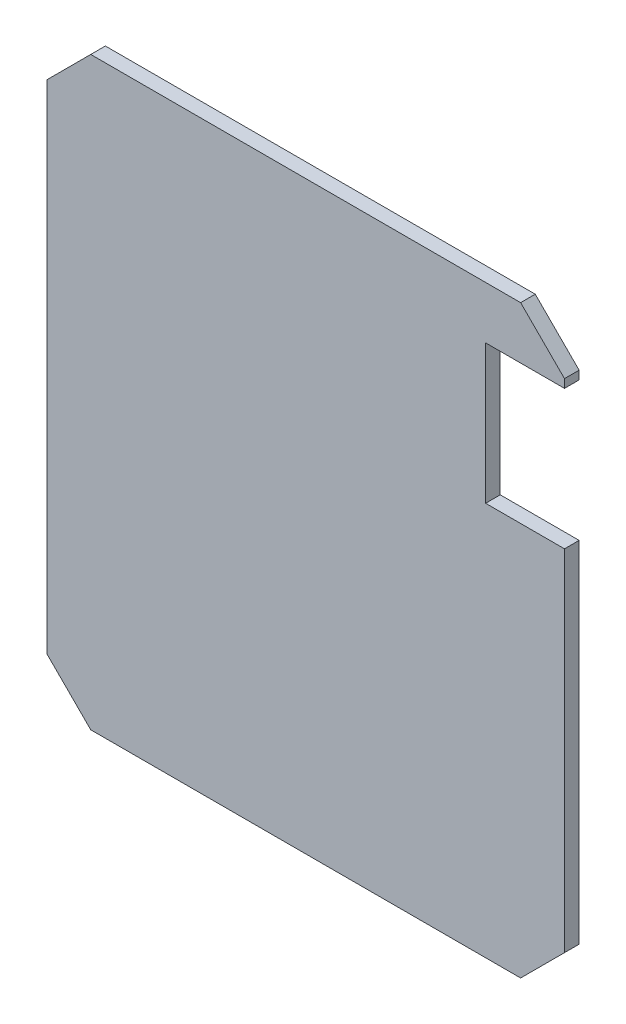
ISO-10303-21;
HEADER;
FILE_DESCRIPTION(('STEP AP214'),'2;1');
FILE_NAME('part.step','',(''),(''),'','','');
FILE_SCHEMA(('AUTOMOTIVE_DESIGN { 1 0 10303 214 1 1 1 1 }'));
ENDSEC;
DATA;
#1=APPLICATION_CONTEXT('core data for automotive mechanical design processes');
#2=APPLICATION_PROTOCOL_DEFINITION('international standard','automotive_design',2000,#1);
#3=PRODUCT_CONTEXT('',#1,'mechanical');
#4=PRODUCT('Part','Part','',(#3));
#5=PRODUCT_RELATED_PRODUCT_CATEGORY('part','',(#4));
#6=PRODUCT_DEFINITION_FORMATION('','',#4);
#7=PRODUCT_DEFINITION_CONTEXT('part definition',#1,'design');
#8=PRODUCT_DEFINITION('design','',#6,#7);
#9=PRODUCT_DEFINITION_SHAPE('','',#8);
#10=(LENGTH_UNIT() NAMED_UNIT(*) SI_UNIT(.MILLI.,.METRE.));
#11=(NAMED_UNIT(*) PLANE_ANGLE_UNIT() SI_UNIT($,.RADIAN.));
#12=(NAMED_UNIT(*) SI_UNIT($,.STERADIAN.) SOLID_ANGLE_UNIT());
#13=UNCERTAINTY_MEASURE_WITH_UNIT(LENGTH_MEASURE(1.E-05),#10,'distance_accuracy_value','');
#14=(GEOMETRIC_REPRESENTATION_CONTEXT(3) GLOBAL_UNCERTAINTY_ASSIGNED_CONTEXT((#13)) GLOBAL_UNIT_ASSIGNED_CONTEXT((#10,
#11,#12)) REPRESENTATION_CONTEXT('',''));
#15=CARTESIAN_POINT('',(0.,0.,0.));
#16=DIRECTION('',(0.,0.,1.));
#17=DIRECTION('',(1.,0.,0.));
#18=AXIS2_PLACEMENT_3D('',#15,#16,#17);
#19=CARTESIAN_POINT('',(17.7,-17.,1.));
#20=DIRECTION('',(-1.,0.,0.));
#21=DIRECTION('',(0.,0.,1.));
#22=AXIS2_PLACEMENT_3D('',#19,#20,#21);
#23=PLANE('',#22);
#24=DIRECTION('',(0.,1.,0.));
#25=VECTOR('',#24,1.);
#26=CARTESIAN_POINT('',(17.7,-17.,0.));
#27=LINE('',#26,#25);
#28=CARTESIAN_POINT('',(17.7,-17.,0.));
#29=VERTEX_POINT('',#28);
#30=CARTESIAN_POINT('',(17.7,6.9196672593355,0.));
#31=VERTEX_POINT('',#30);
#32=EDGE_CURVE('E161',#29,#31,#27,.T.);
#33=ORIENTED_EDGE('',*,*,#32,.T.);
#34=DIRECTION('',(0.,0.,1.));
#35=VECTOR('',#34,1.);
#36=CARTESIAN_POINT('',(17.7,6.9196672593355,0.));
#37=LINE('',#36,#35);
#38=CARTESIAN_POINT('',(17.7,6.9196672593355,1.));
#39=VERTEX_POINT('',#38);
#40=EDGE_CURVE('E153',#31,#39,#37,.T.);
#41=ORIENTED_EDGE('',*,*,#40,.T.);
#42=DIRECTION('',(0.,1.,0.));
#43=VECTOR('',#42,1.);
#44=CARTESIAN_POINT('',(17.7,-17.,1.));
#45=LINE('',#44,#43);
#46=CARTESIAN_POINT('',(17.7,-17.,1.));
#47=VERTEX_POINT('',#46);
#48=EDGE_CURVE('E130',#47,#39,#45,.T.);
#49=ORIENTED_EDGE('',*,*,#48,.F.);
#50=DIRECTION('',(0.,0.,-1.));
#51=VECTOR('',#50,1.);
#52=CARTESIAN_POINT('',(17.7,-17.,1.));
#53=LINE('',#52,#51);
#54=EDGE_CURVE('E140',#47,#29,#53,.T.);
#55=ORIENTED_EDGE('',*,*,#54,.T.);
#56=EDGE_LOOP('',(#33,#41,#49,#55));
#57=FACE_BOUND('',#56,.T.);
#58=ADVANCED_FACE('F35',(#57),#23,.F.);
#59=CARTESIAN_POINT('',(-14.7,20.,1.));
#60=DIRECTION('',(0.707106781186547,-0.707106781186547,0.));
#61=DIRECTION('',(0.707106781186548,0.707106781186548,0.));
#62=AXIS2_PLACEMENT_3D('',#59,#60,#61);
#63=PLANE('',#62);
#64=DIRECTION('',(-0.707106781186548,-0.707106781186548,0.));
#65=VECTOR('',#64,1.);
#66=CARTESIAN_POINT('',(-14.7,20.,0.));
#67=LINE('',#66,#65);
#68=CARTESIAN_POINT('',(-14.7,20.,0.));
#69=VERTEX_POINT('',#68);
#70=CARTESIAN_POINT('',(-17.7,17.,0.));
#71=VERTEX_POINT('',#70);
#72=EDGE_CURVE('E149',#69,#71,#67,.T.);
#73=ORIENTED_EDGE('',*,*,#72,.T.);
#74=DIRECTION('',(0.,0.,-1.));
#75=VECTOR('',#74,1.);
#76=CARTESIAN_POINT('',(-17.7,17.,1.));
#77=LINE('',#76,#75);
#78=CARTESIAN_POINT('',(-17.7,17.,1.));
#79=VERTEX_POINT('',#78);
#80=EDGE_CURVE('E11',#79,#71,#77,.T.);
#81=ORIENTED_EDGE('',*,*,#80,.F.);
#82=DIRECTION('',(-0.707106781186548,-0.707106781186548,0.));
#83=VECTOR('',#82,1.);
#84=CARTESIAN_POINT('',(-14.7,20.,1.));
#85=LINE('',#84,#83);
#86=CARTESIAN_POINT('',(-14.7,20.,1.));
#87=VERTEX_POINT('',#86);
#88=EDGE_CURVE('E167',#87,#79,#85,.T.);
#89=ORIENTED_EDGE('',*,*,#88,.F.);
#90=DIRECTION('',(0.,0.,-1.));
#91=VECTOR('',#90,1.);
#92=CARTESIAN_POINT('',(-14.7,20.,1.));
#93=LINE('',#92,#91);
#94=EDGE_CURVE('E145',#87,#69,#93,.T.);
#95=ORIENTED_EDGE('',*,*,#94,.T.);
#96=EDGE_LOOP('',(#73,#81,#89,#95));
#97=FACE_BOUND('',#96,.T.);
#98=ADVANCED_FACE('F37',(#97),#63,.F.);
#99=CARTESIAN_POINT('',(-17.7,-17.,1.));
#100=DIRECTION('',(1.,0.,0.));
#101=DIRECTION('',(0.,0.,-1.));
#102=AXIS2_PLACEMENT_3D('',#99,#100,#101);
#103=PLANE('',#102);
#104=DIRECTION('',(0.,-1.,0.));
#105=VECTOR('',#104,1.);
#106=CARTESIAN_POINT('',(-17.7,-17.,0.));
#107=LINE('',#106,#105);
#108=CARTESIAN_POINT('',(-17.7,-17.,0.));
#109=VERTEX_POINT('',#108);
#110=EDGE_CURVE('E152',#71,#109,#107,.T.);
#111=ORIENTED_EDGE('',*,*,#110,.T.);
#112=DIRECTION('',(0.,0.,-1.));
#113=VECTOR('',#112,1.);
#114=CARTESIAN_POINT('',(-17.7,-17.,1.));
#115=LINE('',#114,#113);
#116=CARTESIAN_POINT('',(-17.7,-17.,1.));
#117=VERTEX_POINT('',#116);
#118=EDGE_CURVE('E43',#117,#109,#115,.T.);
#119=ORIENTED_EDGE('',*,*,#118,.F.);
#120=DIRECTION('',(0.,-1.,0.));
#121=VECTOR('',#120,1.);
#122=CARTESIAN_POINT('',(-17.7,-17.,1.));
#123=LINE('',#122,#121);
#124=EDGE_CURVE('E100',#79,#117,#123,.T.);
#125=ORIENTED_EDGE('',*,*,#124,.F.);
#126=ORIENTED_EDGE('',*,*,#80,.T.);
#127=EDGE_LOOP('',(#111,#119,#125,#126));
#128=FACE_BOUND('',#127,.T.);
#129=ADVANCED_FACE('F254',(#128),#103,.F.);
#130=CARTESIAN_POINT('',(-14.7,-20.,1.));
#131=DIRECTION('',(0.707106781186547,0.707106781186547,0.));
#132=DIRECTION('',(-0.707106781186548,0.707106781186548,0.));
#133=AXIS2_PLACEMENT_3D('',#130,#131,#132);
#134=PLANE('',#133);
#135=DIRECTION('',(0.707106781186548,-0.707106781186548,0.));
#136=VECTOR('',#135,1.);
#137=CARTESIAN_POINT('',(-14.7,-20.,0.));
#138=LINE('',#137,#136);
#139=CARTESIAN_POINT('',(-14.7,-20.,0.));
#140=VERTEX_POINT('',#139);
#141=EDGE_CURVE('E155',#109,#140,#138,.T.);
#142=ORIENTED_EDGE('',*,*,#141,.T.);
#143=DIRECTION('',(0.,0.,-1.));
#144=VECTOR('',#143,1.);
#145=CARTESIAN_POINT('',(-14.7,-20.,1.));
#146=LINE('',#145,#144);
#147=CARTESIAN_POINT('',(-14.7,-20.,1.));
#148=VERTEX_POINT('',#147);
#149=EDGE_CURVE('E175',#148,#140,#146,.T.);
#150=ORIENTED_EDGE('',*,*,#149,.F.);
#151=DIRECTION('',(0.707106781186548,-0.707106781186548,0.));
#152=VECTOR('',#151,1.);
#153=CARTESIAN_POINT('',(-14.7,-20.,1.));
#154=LINE('',#153,#152);
#155=EDGE_CURVE('E183',#117,#148,#154,.T.);
#156=ORIENTED_EDGE('',*,*,#155,.F.);
#157=ORIENTED_EDGE('',*,*,#118,.T.);
#158=EDGE_LOOP('',(#142,#150,#156,#157));
#159=FACE_BOUND('',#158,.T.);
#160=ADVANCED_FACE('F181',(#159),#134,.F.);
#161=CARTESIAN_POINT('',(14.7,-20.,1.));
#162=DIRECTION('',(0.,1.,0.));
#163=DIRECTION('',(0.,0.,1.));
#164=AXIS2_PLACEMENT_3D('',#161,#162,#163);
#165=PLANE('',#164);
#166=DIRECTION('',(1.,0.,0.));
#167=VECTOR('',#166,1.);
#168=CARTESIAN_POINT('',(14.7,-20.,0.));
#169=LINE('',#168,#167);
#170=CARTESIAN_POINT('',(14.7,-20.,0.));
#171=VERTEX_POINT('',#170);
#172=EDGE_CURVE('E157',#140,#171,#169,.T.);
#173=ORIENTED_EDGE('',*,*,#172,.T.);
#174=DIRECTION('',(0.,0.,-1.));
#175=VECTOR('',#174,1.);
#176=CARTESIAN_POINT('',(14.7,-20.,1.));
#177=LINE('',#176,#175);
#178=CARTESIAN_POINT('',(14.7,-20.,1.));
#179=VERTEX_POINT('',#178);
#180=EDGE_CURVE('E172',#179,#171,#177,.T.);
#181=ORIENTED_EDGE('',*,*,#180,.F.);
#182=DIRECTION('',(1.,0.,0.));
#183=VECTOR('',#182,1.);
#184=CARTESIAN_POINT('',(14.7,-20.,1.));
#185=LINE('',#184,#183);
#186=EDGE_CURVE('E200',#148,#179,#185,.T.);
#187=ORIENTED_EDGE('',*,*,#186,.F.);
#188=ORIENTED_EDGE('',*,*,#149,.T.);
#189=EDGE_LOOP('',(#173,#181,#187,#188));
#190=FACE_BOUND('',#189,.T.);
#191=ADVANCED_FACE('F193',(#190),#165,.F.);
#192=CARTESIAN_POINT('',(17.7,-17.,1.));
#193=DIRECTION('',(-0.707106781186547,0.707106781186547,0.));
#194=DIRECTION('',(-0.707106781186548,-0.707106781186548,0.));
#195=AXIS2_PLACEMENT_3D('',#192,#193,#194);
#196=PLANE('',#195);
#197=DIRECTION('',(0.707106781186548,0.707106781186548,0.));
#198=VECTOR('',#197,1.);
#199=CARTESIAN_POINT('',(17.7,-17.,0.));
#200=LINE('',#199,#198);
#201=EDGE_CURVE('E159',#171,#29,#200,.T.);
#202=ORIENTED_EDGE('',*,*,#201,.T.);
#203=ORIENTED_EDGE('',*,*,#54,.F.);
#204=DIRECTION('',(0.707106781186548,0.707106781186548,0.));
#205=VECTOR('',#204,1.);
#206=CARTESIAN_POINT('',(17.7,-17.,1.));
#207=LINE('',#206,#205);
#208=EDGE_CURVE('E131',#179,#47,#207,.T.);
#209=ORIENTED_EDGE('',*,*,#208,.F.);
#210=ORIENTED_EDGE('',*,*,#180,.T.);
#211=EDGE_LOOP('',(#202,#203,#209,#210));
#212=FACE_BOUND('',#211,.T.);
#213=ADVANCED_FACE('F197',(#212),#196,.F.);
#214=CARTESIAN_POINT('',(17.7,16.4206197612415,1.));
#215=VERTEX_POINT('',#214);
#216=CARTESIAN_POINT('',(17.7,17.,1.));
#217=VERTEX_POINT('',#216);
#218=EDGE_CURVE('E117',#215,#217,#45,.T.);
#219=ORIENTED_EDGE('',*,*,#218,.F.);
#220=DIRECTION('',(0.,0.,1.));
#221=VECTOR('',#220,1.);
#222=CARTESIAN_POINT('',(17.7,16.4206197612415,0.));
#223=LINE('',#222,#221);
#224=CARTESIAN_POINT('',(17.7,16.4206197612415,0.));
#225=VERTEX_POINT('',#224);
#226=EDGE_CURVE('E206',#225,#215,#223,.T.);
#227=ORIENTED_EDGE('',*,*,#226,.F.);
#228=CARTESIAN_POINT('',(17.7,17.,0.));
#229=VERTEX_POINT('',#228);
#230=EDGE_CURVE('E137',#225,#229,#27,.T.);
#231=ORIENTED_EDGE('',*,*,#230,.T.);
#232=DIRECTION('',(0.,0.,-1.));
#233=VECTOR('',#232,1.);
#234=CARTESIAN_POINT('',(17.7,17.,1.));
#235=LINE('',#234,#233);
#236=EDGE_CURVE('E134',#217,#229,#235,.T.);
#237=ORIENTED_EDGE('',*,*,#236,.F.);
#238=EDGE_LOOP('',(#219,#227,#231,#237));
#239=FACE_BOUND('',#238,.T.);
#240=ADVANCED_FACE('F135',(#239),#23,.F.);
#241=CARTESIAN_POINT('',(17.7,17.,1.));
#242=DIRECTION('',(-0.707106781186547,-0.707106781186547,0.));
#243=DIRECTION('',(0.707106781186548,-0.707106781186548,0.));
#244=AXIS2_PLACEMENT_3D('',#241,#242,#243);
#245=PLANE('',#244);
#246=DIRECTION('',(-0.707106781186548,0.707106781186548,0.));
#247=VECTOR('',#246,1.);
#248=CARTESIAN_POINT('',(17.7,17.,0.));
#249=LINE('',#248,#247);
#250=CARTESIAN_POINT('',(14.7,20.,0.));
#251=VERTEX_POINT('',#250);
#252=EDGE_CURVE('E164',#229,#251,#249,.T.);
#253=ORIENTED_EDGE('',*,*,#252,.T.);
#254=DIRECTION('',(0.,0.,-1.));
#255=VECTOR('',#254,1.);
#256=CARTESIAN_POINT('',(14.7,20.,1.));
#257=LINE('',#256,#255);
#258=CARTESIAN_POINT('',(14.7,20.,1.));
#259=VERTEX_POINT('',#258);
#260=EDGE_CURVE('E141',#259,#251,#257,.T.);
#261=ORIENTED_EDGE('',*,*,#260,.F.);
#262=DIRECTION('',(-0.707106781186548,0.707106781186548,0.));
#263=VECTOR('',#262,1.);
#264=CARTESIAN_POINT('',(17.7,17.,1.));
#265=LINE('',#264,#263);
#266=EDGE_CURVE('E122',#217,#259,#265,.T.);
#267=ORIENTED_EDGE('',*,*,#266,.F.);
#268=ORIENTED_EDGE('',*,*,#236,.T.);
#269=EDGE_LOOP('',(#253,#261,#267,#268));
#270=FACE_BOUND('',#269,.T.);
#271=ADVANCED_FACE('F143',(#270),#245,.F.);
#272=CARTESIAN_POINT('',(14.7,20.,1.));
#273=DIRECTION('',(0.,-1.,0.));
#274=DIRECTION('',(0.,0.,-1.));
#275=AXIS2_PLACEMENT_3D('',#272,#273,#274);
#276=PLANE('',#275);
#277=DIRECTION('',(-1.,0.,0.));
#278=VECTOR('',#277,1.);
#279=CARTESIAN_POINT('',(14.7,20.,0.));
#280=LINE('',#279,#278);
#281=EDGE_CURVE('E92',#251,#69,#280,.T.);
#282=ORIENTED_EDGE('',*,*,#281,.T.);
#283=ORIENTED_EDGE('',*,*,#94,.F.);
#284=DIRECTION('',(-1.,0.,0.));
#285=VECTOR('',#284,1.);
#286=CARTESIAN_POINT('',(14.7,20.,1.));
#287=LINE('',#286,#285);
#288=EDGE_CURVE('E59',#259,#87,#287,.T.);
#289=ORIENTED_EDGE('',*,*,#288,.F.);
#290=ORIENTED_EDGE('',*,*,#260,.T.);
#291=EDGE_LOOP('',(#282,#283,#289,#290));
#292=FACE_BOUND('',#291,.T.);
#293=ADVANCED_FACE('F262',(#292),#276,.F.);
#294=CARTESIAN_POINT('',(0.,0.,1.));
#295=DIRECTION('',(0.,0.,-1.));
#296=DIRECTION('',(-1.,0.,0.));
#297=AXIS2_PLACEMENT_3D('',#294,#295,#296);
#298=PLANE('',#297);
#299=ORIENTED_EDGE('',*,*,#48,.T.);
#300=DIRECTION('',(1.,0.,0.));
#301=VECTOR('',#300,1.);
#302=CARTESIAN_POINT('',(17.7,6.9196672593355,1.));
#303=LINE('',#302,#301);
#304=CARTESIAN_POINT('',(12.305816611634,6.9196672593355,1.));
#305=VERTEX_POINT('',#304);
#306=EDGE_CURVE('E217',#305,#39,#303,.T.);
#307=ORIENTED_EDGE('',*,*,#306,.F.);
#308=DIRECTION('',(0.,-1.,0.));
#309=VECTOR('',#308,1.);
#310=CARTESIAN_POINT('',(12.305816611634,16.4206197612415,1.));
#311=LINE('',#310,#309);
#312=CARTESIAN_POINT('',(12.305816611634,16.4206197612415,1.));
#313=VERTEX_POINT('',#312);
#314=EDGE_CURVE('E221',#313,#305,#311,.T.);
#315=ORIENTED_EDGE('',*,*,#314,.F.);
#316=DIRECTION('',(-1.,0.,0.));
#317=VECTOR('',#316,1.);
#318=CARTESIAN_POINT('',(17.7,16.4206197612415,1.));
#319=LINE('',#318,#317);
#320=EDGE_CURVE('E127',#215,#313,#319,.T.);
#321=ORIENTED_EDGE('',*,*,#320,.F.);
#322=ORIENTED_EDGE('',*,*,#218,.T.);
#323=ORIENTED_EDGE('',*,*,#266,.T.);
#324=ORIENTED_EDGE('',*,*,#288,.T.);
#325=ORIENTED_EDGE('',*,*,#88,.T.);
#326=ORIENTED_EDGE('',*,*,#124,.T.);
#327=ORIENTED_EDGE('',*,*,#155,.T.);
#328=ORIENTED_EDGE('',*,*,#186,.T.);
#329=ORIENTED_EDGE('',*,*,#208,.T.);
#330=EDGE_LOOP('',(#299,#307,#315,#321,#322,#323,#324,#325,#326,#327,#328,#329));
#331=FACE_BOUND('',#330,.T.);
#332=ADVANCED_FACE('F120',(#331),#298,.F.);
#333=CARTESIAN_POINT('',(0.,0.,0.));
#334=DIRECTION('',(0.,0.,-1.));
#335=DIRECTION('',(-1.,0.,0.));
#336=AXIS2_PLACEMENT_3D('',#333,#334,#335);
#337=PLANE('',#336);
#338=DIRECTION('',(1.,0.,0.));
#339=VECTOR('',#338,1.);
#340=CARTESIAN_POINT('',(17.7,6.9196672593355,0.));
#341=LINE('',#340,#339);
#342=CARTESIAN_POINT('',(12.305816611634,6.9196672593355,0.));
#343=VERTEX_POINT('',#342);
#344=EDGE_CURVE('E210',#343,#31,#341,.T.);
#345=ORIENTED_EDGE('',*,*,#344,.T.);
#346=ORIENTED_EDGE('',*,*,#32,.F.);
#347=ORIENTED_EDGE('',*,*,#201,.F.);
#348=ORIENTED_EDGE('',*,*,#172,.F.);
#349=ORIENTED_EDGE('',*,*,#141,.F.);
#350=ORIENTED_EDGE('',*,*,#110,.F.);
#351=ORIENTED_EDGE('',*,*,#72,.F.);
#352=ORIENTED_EDGE('',*,*,#281,.F.);
#353=ORIENTED_EDGE('',*,*,#252,.F.);
#354=ORIENTED_EDGE('',*,*,#230,.F.);
#355=DIRECTION('',(-1.,0.,0.));
#356=VECTOR('',#355,1.);
#357=CARTESIAN_POINT('',(17.7,16.4206197612415,0.));
#358=LINE('',#357,#356);
#359=CARTESIAN_POINT('',(12.305816611634,16.4206197612415,0.));
#360=VERTEX_POINT('',#359);
#361=EDGE_CURVE('E220',#225,#360,#358,.T.);
#362=ORIENTED_EDGE('',*,*,#361,.T.);
#363=DIRECTION('',(0.,-1.,0.));
#364=VECTOR('',#363,1.);
#365=CARTESIAN_POINT('',(12.305816611634,16.4206197612415,0.));
#366=LINE('',#365,#364);
#367=EDGE_CURVE('E50',#360,#343,#366,.T.);
#368=ORIENTED_EDGE('',*,*,#367,.T.);
#369=EDGE_LOOP('',(#345,#346,#347,#348,#349,#350,#351,#352,#353,#354,#362,#368));
#370=FACE_BOUND('',#369,.T.);
#371=ADVANCED_FACE('F187',(#370),#337,.T.);
#372=CARTESIAN_POINT('',(17.7,6.9196672593355,0.));
#373=DIRECTION('',(0.,-1.,0.));
#374=DIRECTION('',(0.,0.,-1.));
#375=AXIS2_PLACEMENT_3D('',#372,#373,#374);
#376=PLANE('',#375);
#377=ORIENTED_EDGE('',*,*,#306,.T.);
#378=ORIENTED_EDGE('',*,*,#40,.F.);
#379=ORIENTED_EDGE('',*,*,#344,.F.);
#380=DIRECTION('',(0.,0.,1.));
#381=VECTOR('',#380,1.);
#382=CARTESIAN_POINT('',(12.305816611634,6.9196672593355,0.));
#383=LINE('',#382,#381);
#384=EDGE_CURVE('E212',#343,#305,#383,.T.);
#385=ORIENTED_EDGE('',*,*,#384,.T.);
#386=EDGE_LOOP('',(#377,#378,#379,#385));
#387=FACE_BOUND('',#386,.T.);
#388=ADVANCED_FACE('F243',(#387),#376,.F.);
#389=CARTESIAN_POINT('',(12.305816611634,16.4206197612415,0.));
#390=DIRECTION('',(-1.,0.,0.));
#391=DIRECTION('',(0.,0.,1.));
#392=AXIS2_PLACEMENT_3D('',#389,#390,#391);
#393=PLANE('',#392);
#394=ORIENTED_EDGE('',*,*,#314,.T.);
#395=ORIENTED_EDGE('',*,*,#384,.F.);
#396=ORIENTED_EDGE('',*,*,#367,.F.);
#397=DIRECTION('',(0.,0.,1.));
#398=VECTOR('',#397,1.);
#399=CARTESIAN_POINT('',(12.305816611634,16.4206197612415,0.));
#400=LINE('',#399,#398);
#401=EDGE_CURVE('E209',#360,#313,#400,.T.);
#402=ORIENTED_EDGE('',*,*,#401,.T.);
#403=EDGE_LOOP('',(#394,#395,#396,#402));
#404=FACE_BOUND('',#403,.T.);
#405=ADVANCED_FACE('F245',(#404),#393,.F.);
#406=CARTESIAN_POINT('',(17.7,16.4206197612415,0.));
#407=DIRECTION('',(0.,1.,0.));
#408=DIRECTION('',(0.,0.,1.));
#409=AXIS2_PLACEMENT_3D('',#406,#407,#408);
#410=PLANE('',#409);
#411=ORIENTED_EDGE('',*,*,#320,.T.);
#412=ORIENTED_EDGE('',*,*,#401,.F.);
#413=ORIENTED_EDGE('',*,*,#361,.F.);
#414=ORIENTED_EDGE('',*,*,#226,.T.);
#415=EDGE_LOOP('',(#411,#412,#413,#414));
#416=FACE_BOUND('',#415,.T.);
#417=ADVANCED_FACE('F232',(#416),#410,.F.);
#418=CLOSED_SHELL('',(#58,#98,#129,#160,#191,#213,#240,#271,#293,#332,#371,#388,#405,#417));
#419=MANIFOLD_SOLID_BREP('B2',#418);
#420=ADVANCED_BREP_SHAPE_REPRESENTATION('',(#18,#419),#14);
#421=SHAPE_DEFINITION_REPRESENTATION(#9,#420);
ENDSEC;
END-ISO-10303-21;
